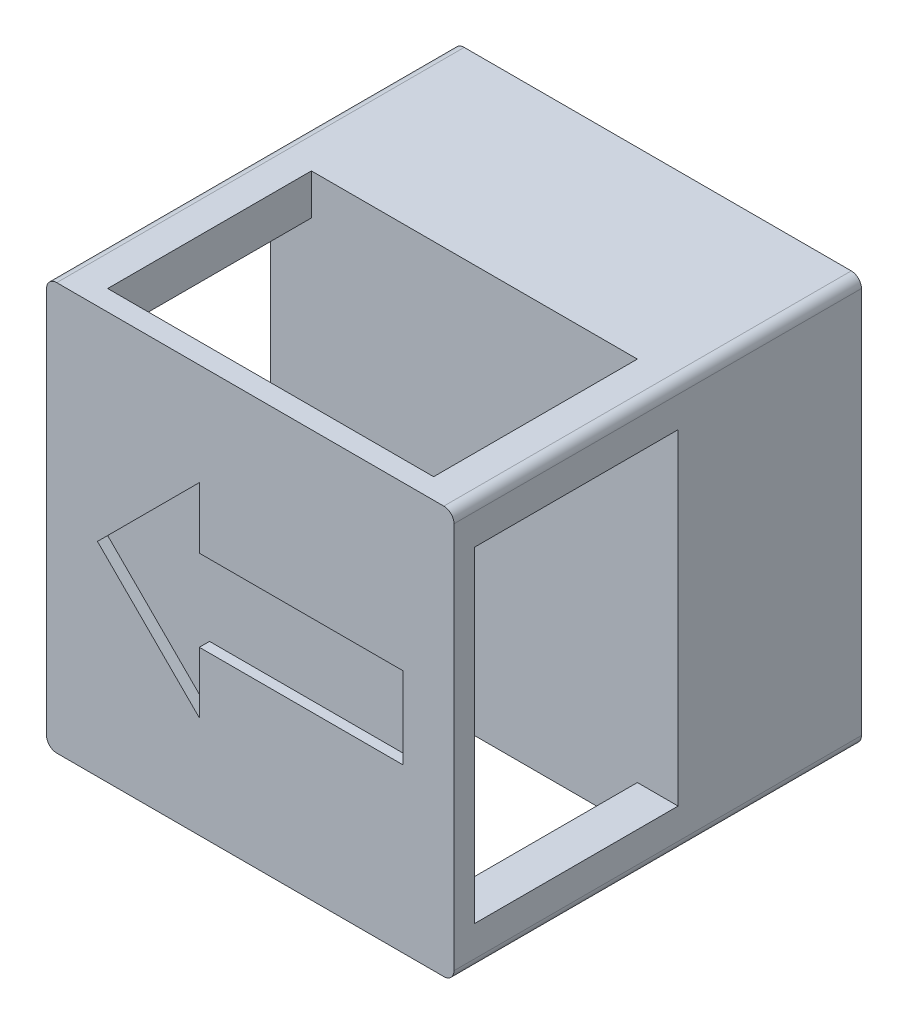
ISO-10303-21;
HEADER;
FILE_DESCRIPTION(('STEP AP214'),'2;1');
FILE_NAME('part.step','',(''),(''),'','','');
FILE_SCHEMA(('AUTOMOTIVE_DESIGN { 1 0 10303 214 1 1 1 1 }'));
ENDSEC;
DATA;
#1=APPLICATION_CONTEXT('core data for automotive mechanical design processes');
#2=APPLICATION_PROTOCOL_DEFINITION('international standard','automotive_design',2000,#1);
#3=PRODUCT_CONTEXT('',#1,'mechanical');
#4=PRODUCT('Part','Part','',(#3));
#5=PRODUCT_RELATED_PRODUCT_CATEGORY('part','',(#4));
#6=PRODUCT_DEFINITION_FORMATION('','',#4);
#7=PRODUCT_DEFINITION_CONTEXT('part definition',#1,'design');
#8=PRODUCT_DEFINITION('design','',#6,#7);
#9=PRODUCT_DEFINITION_SHAPE('','',#8);
#10=(LENGTH_UNIT() NAMED_UNIT(*) SI_UNIT(.MILLI.,.METRE.));
#11=(NAMED_UNIT(*) PLANE_ANGLE_UNIT() SI_UNIT($,.RADIAN.));
#12=(NAMED_UNIT(*) SI_UNIT($,.STERADIAN.) SOLID_ANGLE_UNIT());
#13=UNCERTAINTY_MEASURE_WITH_UNIT(LENGTH_MEASURE(1.E-05),#10,'distance_accuracy_value','');
#14=(GEOMETRIC_REPRESENTATION_CONTEXT(3) GLOBAL_UNCERTAINTY_ASSIGNED_CONTEXT((#13)) GLOBAL_UNIT_ASSIGNED_CONTEXT((#10,
#11,#12)) REPRESENTATION_CONTEXT('',''));
#15=CARTESIAN_POINT('',(0.,0.,0.));
#16=DIRECTION('',(0.,0.,1.));
#17=DIRECTION('',(1.,0.,0.));
#18=AXIS2_PLACEMENT_3D('',#15,#16,#17);
#19=CARTESIAN_POINT('',(200.,-200.,400.));
#20=DIRECTION('',(-1.,0.,0.));
#21=DIRECTION('',(0.,0.,1.));
#22=AXIS2_PLACEMENT_3D('',#19,#20,#21);
#23=PLANE('',#22);
#24=DIRECTION('',(0.,1.,0.));
#25=VECTOR('',#24,1.);
#26=CARTESIAN_POINT('',(200.,-200.,0.));
#27=LINE('',#26,#25);
#28=CARTESIAN_POINT('',(200.,-190.,0.));
#29=VERTEX_POINT('',#28);
#30=CARTESIAN_POINT('',(200.,190.,0.));
#31=VERTEX_POINT('',#30);
#32=EDGE_CURVE('E404',#29,#31,#27,.T.);
#33=ORIENTED_EDGE('',*,*,#32,.T.);
#34=DIRECTION('',(0.,0.,-1.));
#35=VECTOR('',#34,1.);
#36=CARTESIAN_POINT('',(200.,190.,400.));
#37=LINE('',#36,#35);
#38=CARTESIAN_POINT('',(200.,190.,400.));
#39=VERTEX_POINT('',#38);
#40=EDGE_CURVE('E494',#31,#39,#37,.F.);
#41=ORIENTED_EDGE('',*,*,#40,.T.);
#42=DIRECTION('',(0.,1.,0.));
#43=VECTOR('',#42,1.);
#44=CARTESIAN_POINT('',(200.,-200.,400.));
#45=LINE('',#44,#43);
#46=CARTESIAN_POINT('',(200.,-190.,400.));
#47=VERTEX_POINT('',#46);
#48=EDGE_CURVE('E443',#47,#39,#45,.T.);
#49=ORIENTED_EDGE('',*,*,#48,.F.);
#50=DIRECTION('',(0.,0.,-1.));
#51=VECTOR('',#50,1.);
#52=CARTESIAN_POINT('',(200.,-190.,400.));
#53=LINE('',#52,#51);
#54=EDGE_CURVE('E490',#47,#29,#53,.T.);
#55=ORIENTED_EDGE('',*,*,#54,.T.);
#56=EDGE_LOOP('',(#33,#41,#49,#55));
#57=FACE_BOUND('',#56,.T.);
#58=DIRECTION('',(0.,1.,0.));
#59=VECTOR('',#58,1.);
#60=CARTESIAN_POINT('',(200.,0.,180.));
#61=LINE('',#60,#59);
#62=CARTESIAN_POINT('',(200.,-160.,180.));
#63=VERTEX_POINT('',#62);
#64=CARTESIAN_POINT('',(200.,160.,180.));
#65=VERTEX_POINT('',#64);
#66=EDGE_CURVE('E321',#63,#65,#61,.T.);
#67=ORIENTED_EDGE('',*,*,#66,.F.);
#68=DIRECTION('',(0.,0.,1.));
#69=VECTOR('',#68,1.);
#70=CARTESIAN_POINT('',(200.,-160.,180.));
#71=LINE('',#70,#69);
#72=CARTESIAN_POINT('',(200.,-160.,380.));
#73=VERTEX_POINT('',#72);
#74=EDGE_CURVE('E433',#63,#73,#71,.T.);
#75=ORIENTED_EDGE('',*,*,#74,.T.);
#76=DIRECTION('',(0.,1.,0.));
#77=VECTOR('',#76,1.);
#78=CARTESIAN_POINT('',(200.,0.,380.));
#79=LINE('',#78,#77);
#80=CARTESIAN_POINT('',(200.,160.,380.));
#81=VERTEX_POINT('',#80);
#82=EDGE_CURVE('E365',#73,#81,#79,.T.);
#83=ORIENTED_EDGE('',*,*,#82,.T.);
#84=DIRECTION('',(0.,0.,1.));
#85=VECTOR('',#84,1.);
#86=CARTESIAN_POINT('',(200.,160.,180.));
#87=LINE('',#86,#85);
#88=EDGE_CURVE('E429',#65,#81,#87,.T.);
#89=ORIENTED_EDGE('',*,*,#88,.F.);
#90=EDGE_LOOP('',(#67,#75,#83,#89));
#91=FACE_BOUND('',#90,.T.);
#92=ADVANCED_FACE('F38',(#57,#91),#23,.F.);
#93=CARTESIAN_POINT('',(-200.,200.,400.));
#94=DIRECTION('',(0.,-1.,0.));
#95=DIRECTION('',(0.,0.,-1.));
#96=AXIS2_PLACEMENT_3D('',#93,#94,#95);
#97=PLANE('',#96);
#98=DIRECTION('',(-1.,0.,0.));
#99=VECTOR('',#98,1.);
#100=CARTESIAN_POINT('',(-200.,200.,400.));
#101=LINE('',#100,#99);
#102=CARTESIAN_POINT('',(190.,200.,400.));
#103=VERTEX_POINT('',#102);
#104=CARTESIAN_POINT('',(-190.,200.,400.));
#105=VERTEX_POINT('',#104);
#106=EDGE_CURVE('E447',#103,#105,#101,.T.);
#107=ORIENTED_EDGE('',*,*,#106,.F.);
#108=DIRECTION('',(0.,0.,-1.));
#109=VECTOR('',#108,1.);
#110=CARTESIAN_POINT('',(190.,200.,400.));
#111=LINE('',#110,#109);
#112=CARTESIAN_POINT('',(190.,200.,0.));
#113=VERTEX_POINT('',#112);
#114=EDGE_CURVE('E474',#103,#113,#111,.T.);
#115=ORIENTED_EDGE('',*,*,#114,.T.);
#116=DIRECTION('',(-1.,0.,0.));
#117=VECTOR('',#116,1.);
#118=CARTESIAN_POINT('',(-200.,200.,0.));
#119=LINE('',#118,#117);
#120=CARTESIAN_POINT('',(-190.,200.,0.));
#121=VERTEX_POINT('',#120);
#122=EDGE_CURVE('E462',#113,#121,#119,.T.);
#123=ORIENTED_EDGE('',*,*,#122,.T.);
#124=DIRECTION('',(0.,0.,-1.));
#125=VECTOR('',#124,1.);
#126=CARTESIAN_POINT('',(-190.,200.,400.));
#127=LINE('',#126,#125);
#128=EDGE_CURVE('E458',#121,#105,#127,.F.);
#129=ORIENTED_EDGE('',*,*,#128,.T.);
#130=EDGE_LOOP('',(#107,#115,#123,#129));
#131=FACE_BOUND('',#130,.T.);
#132=DIRECTION('',(-1.,0.,0.));
#133=VECTOR('',#132,1.);
#134=CARTESIAN_POINT('',(0.,200.,180.));
#135=LINE('',#134,#133);
#136=CARTESIAN_POINT('',(160.,200.,180.));
#137=VERTEX_POINT('',#136);
#138=CARTESIAN_POINT('',(-160.,200.,180.));
#139=VERTEX_POINT('',#138);
#140=EDGE_CURVE('E332',#137,#139,#135,.T.);
#141=ORIENTED_EDGE('',*,*,#140,.F.);
#142=DIRECTION('',(0.,0.,1.));
#143=VECTOR('',#142,1.);
#144=CARTESIAN_POINT('',(160.,200.,180.));
#145=LINE('',#144,#143);
#146=CARTESIAN_POINT('',(160.,200.,380.));
#147=VERTEX_POINT('',#146);
#148=EDGE_CURVE('E422',#137,#147,#145,.T.);
#149=ORIENTED_EDGE('',*,*,#148,.T.);
#150=DIRECTION('',(-1.,0.,0.));
#151=VECTOR('',#150,1.);
#152=CARTESIAN_POINT('',(0.,200.,380.));
#153=LINE('',#152,#151);
#154=CARTESIAN_POINT('',(-160.,200.,380.));
#155=VERTEX_POINT('',#154);
#156=EDGE_CURVE('E377',#147,#155,#153,.T.);
#157=ORIENTED_EDGE('',*,*,#156,.T.);
#158=DIRECTION('',(0.,0.,1.));
#159=VECTOR('',#158,1.);
#160=CARTESIAN_POINT('',(-160.,200.,180.));
#161=LINE('',#160,#159);
#162=EDGE_CURVE('E419',#139,#155,#161,.T.);
#163=ORIENTED_EDGE('',*,*,#162,.F.);
#164=EDGE_LOOP('',(#141,#149,#157,#163));
#165=FACE_BOUND('',#164,.T.);
#166=ADVANCED_FACE('F548',(#131,#165),#97,.F.);
#167=CARTESIAN_POINT('',(-200.,-200.,400.));
#168=DIRECTION('',(1.,0.,0.));
#169=DIRECTION('',(0.,0.,-1.));
#170=AXIS2_PLACEMENT_3D('',#167,#168,#169);
#171=PLANE('',#170);
#172=DIRECTION('',(0.,-1.,0.));
#173=VECTOR('',#172,1.);
#174=CARTESIAN_POINT('',(-200.,-200.,400.));
#175=LINE('',#174,#173);
#176=CARTESIAN_POINT('',(-200.,190.,400.));
#177=VERTEX_POINT('',#176);
#178=CARTESIAN_POINT('',(-200.,-190.,400.));
#179=VERTEX_POINT('',#178);
#180=EDGE_CURVE('E452',#177,#179,#175,.T.);
#181=ORIENTED_EDGE('',*,*,#180,.F.);
#182=DIRECTION('',(0.,0.,-1.));
#183=VECTOR('',#182,1.);
#184=CARTESIAN_POINT('',(-200.,190.,400.));
#185=LINE('',#184,#183);
#186=CARTESIAN_POINT('',(-200.,190.,0.));
#187=VERTEX_POINT('',#186);
#188=EDGE_CURVE('E511',#177,#187,#185,.T.);
#189=ORIENTED_EDGE('',*,*,#188,.T.);
#190=DIRECTION('',(0.,-1.,0.));
#191=VECTOR('',#190,1.);
#192=CARTESIAN_POINT('',(-200.,-200.,0.));
#193=LINE('',#192,#191);
#194=CARTESIAN_POINT('',(-200.,-190.,0.));
#195=VERTEX_POINT('',#194);
#196=EDGE_CURVE('E466',#187,#195,#193,.T.);
#197=ORIENTED_EDGE('',*,*,#196,.T.);
#198=DIRECTION('',(0.,0.,-1.));
#199=VECTOR('',#198,1.);
#200=CARTESIAN_POINT('',(-200.,-190.,400.));
#201=LINE('',#200,#199);
#202=EDGE_CURVE('E508',#195,#179,#201,.F.);
#203=ORIENTED_EDGE('',*,*,#202,.T.);
#204=EDGE_LOOP('',(#181,#189,#197,#203));
#205=FACE_BOUND('',#204,.T.);
#206=DIRECTION('',(0.,-1.,0.));
#207=VECTOR('',#206,1.);
#208=CARTESIAN_POINT('',(-200.,0.,180.));
#209=LINE('',#208,#207);
#210=CARTESIAN_POINT('',(-200.,160.,180.));
#211=VERTEX_POINT('',#210);
#212=CARTESIAN_POINT('',(-200.,-160.,180.));
#213=VERTEX_POINT('',#212);
#214=EDGE_CURVE('E343',#211,#213,#209,.T.);
#215=ORIENTED_EDGE('',*,*,#214,.F.);
#216=DIRECTION('',(0.,0.,1.));
#217=VECTOR('',#216,1.);
#218=CARTESIAN_POINT('',(-200.,160.,180.));
#219=LINE('',#218,#217);
#220=CARTESIAN_POINT('',(-200.,160.,380.));
#221=VERTEX_POINT('',#220);
#222=EDGE_CURVE('E412',#211,#221,#219,.T.);
#223=ORIENTED_EDGE('',*,*,#222,.T.);
#224=DIRECTION('',(0.,-1.,0.));
#225=VECTOR('',#224,1.);
#226=CARTESIAN_POINT('',(-200.,0.,380.));
#227=LINE('',#226,#225);
#228=CARTESIAN_POINT('',(-200.,-160.,380.));
#229=VERTEX_POINT('',#228);
#230=EDGE_CURVE('E389',#221,#229,#227,.T.);
#231=ORIENTED_EDGE('',*,*,#230,.T.);
#232=DIRECTION('',(0.,0.,1.));
#233=VECTOR('',#232,1.);
#234=CARTESIAN_POINT('',(-200.,-160.,180.));
#235=LINE('',#234,#233);
#236=EDGE_CURVE('E408',#213,#229,#235,.T.);
#237=ORIENTED_EDGE('',*,*,#236,.F.);
#238=EDGE_LOOP('',(#215,#223,#231,#237));
#239=FACE_BOUND('',#238,.T.);
#240=ADVANCED_FACE('F519',(#205,#239),#171,.F.);
#241=CARTESIAN_POINT('',(-200.,-200.,400.));
#242=DIRECTION('',(0.,1.,0.));
#243=DIRECTION('',(0.,0.,1.));
#244=AXIS2_PLACEMENT_3D('',#241,#242,#243);
#245=PLANE('',#244);
#246=DIRECTION('',(1.,0.,0.));
#247=VECTOR('',#246,1.);
#248=CARTESIAN_POINT('',(-200.,-200.,400.));
#249=LINE('',#248,#247);
#250=CARTESIAN_POINT('',(-190.,-200.,400.));
#251=VERTEX_POINT('',#250);
#252=CARTESIAN_POINT('',(190.,-200.,400.));
#253=VERTEX_POINT('',#252);
#254=EDGE_CURVE('E455',#251,#253,#249,.T.);
#255=ORIENTED_EDGE('',*,*,#254,.F.);
#256=DIRECTION('',(0.,0.,-1.));
#257=VECTOR('',#256,1.);
#258=CARTESIAN_POINT('',(-190.,-200.,400.));
#259=LINE('',#258,#257);
#260=CARTESIAN_POINT('',(-190.,-200.,0.));
#261=VERTEX_POINT('',#260);
#262=EDGE_CURVE('E11',#251,#261,#259,.T.);
#263=ORIENTED_EDGE('',*,*,#262,.T.);
#264=DIRECTION('',(1.,0.,0.));
#265=VECTOR('',#264,1.);
#266=CARTESIAN_POINT('',(-200.,-200.,0.));
#267=LINE('',#266,#265);
#268=CARTESIAN_POINT('',(190.,-200.,0.));
#269=VERTEX_POINT('',#268);
#270=EDGE_CURVE('E448',#261,#269,#267,.T.);
#271=ORIENTED_EDGE('',*,*,#270,.T.);
#272=DIRECTION('',(0.,0.,-1.));
#273=VECTOR('',#272,1.);
#274=CARTESIAN_POINT('',(190.,-200.,400.));
#275=LINE('',#274,#273);
#276=EDGE_CURVE('E47',#269,#253,#275,.F.);
#277=ORIENTED_EDGE('',*,*,#276,.T.);
#278=EDGE_LOOP('',(#255,#263,#271,#277));
#279=FACE_BOUND('',#278,.T.);
#280=DIRECTION('',(1.,0.,0.));
#281=VECTOR('',#280,1.);
#282=CARTESIAN_POINT('',(0.,-200.,180.));
#283=LINE('',#282,#281);
#284=CARTESIAN_POINT('',(-160.,-200.,180.));
#285=VERTEX_POINT('',#284);
#286=CARTESIAN_POINT('',(160.,-200.,180.));
#287=VERTEX_POINT('',#286);
#288=EDGE_CURVE('E309',#285,#287,#283,.T.);
#289=ORIENTED_EDGE('',*,*,#288,.F.);
#290=DIRECTION('',(0.,0.,1.));
#291=VECTOR('',#290,1.);
#292=CARTESIAN_POINT('',(-160.,-200.,180.));
#293=LINE('',#292,#291);
#294=CARTESIAN_POINT('',(-160.,-200.,380.));
#295=VERTEX_POINT('',#294);
#296=EDGE_CURVE('E400',#285,#295,#293,.T.);
#297=ORIENTED_EDGE('',*,*,#296,.T.);
#298=DIRECTION('',(1.,0.,0.));
#299=VECTOR('',#298,1.);
#300=CARTESIAN_POINT('',(0.,-200.,380.));
#301=LINE('',#300,#299);
#302=CARTESIAN_POINT('',(160.,-200.,380.));
#303=VERTEX_POINT('',#302);
#304=EDGE_CURVE('E294',#295,#303,#301,.T.);
#305=ORIENTED_EDGE('',*,*,#304,.T.);
#306=DIRECTION('',(0.,0.,1.));
#307=VECTOR('',#306,1.);
#308=CARTESIAN_POINT('',(160.,-200.,180.));
#309=LINE('',#308,#307);
#310=EDGE_CURVE('E354',#287,#303,#309,.T.);
#311=ORIENTED_EDGE('',*,*,#310,.F.);
#312=EDGE_LOOP('',(#289,#297,#305,#311));
#313=FACE_BOUND('',#312,.T.);
#314=ADVANCED_FACE('F531',(#279,#313),#245,.F.);
#315=CARTESIAN_POINT('',(0.,0.,400.));
#316=DIRECTION('',(0.,0.,-1.));
#317=DIRECTION('',(-1.,0.,0.));
#318=AXIS2_PLACEMENT_3D('',#315,#316,#317);
#319=PLANE('',#318);
#320=DIRECTION('',(0.,1.,0.));
#321=VECTOR('',#320,1.);
#322=CARTESIAN_POINT('',(-50.,-40.,400.));
#323=LINE('',#322,#321);
#324=CARTESIAN_POINT('',(-50.,-100.,400.));
#325=VERTEX_POINT('',#324);
#326=CARTESIAN_POINT('',(-50.,-40.,400.));
#327=VERTEX_POINT('',#326);
#328=EDGE_CURVE('E273',#325,#327,#323,.T.);
#329=ORIENTED_EDGE('',*,*,#328,.F.);
#330=DIRECTION('',(0.707106781186547,-0.707106781186547,0.));
#331=VECTOR('',#330,1.);
#332=CARTESIAN_POINT('',(-50.,-100.,400.));
#333=LINE('',#332,#331);
#334=CARTESIAN_POINT('',(-150.,0.,400.));
#335=VERTEX_POINT('',#334);
#336=EDGE_CURVE('E226',#335,#325,#333,.T.);
#337=ORIENTED_EDGE('',*,*,#336,.F.);
#338=DIRECTION('',(-0.707106781186547,-0.707106781186547,0.));
#339=VECTOR('',#338,1.);
#340=CARTESIAN_POINT('',(-150.,0.,400.));
#341=LINE('',#340,#339);
#342=CARTESIAN_POINT('',(-50.,100.,400.));
#343=VERTEX_POINT('',#342);
#344=EDGE_CURVE('E247',#343,#335,#341,.T.);
#345=ORIENTED_EDGE('',*,*,#344,.F.);
#346=DIRECTION('',(0.,1.,0.));
#347=VECTOR('',#346,1.);
#348=CARTESIAN_POINT('',(-50.,100.,400.));
#349=LINE('',#348,#347);
#350=CARTESIAN_POINT('',(-50.,40.,400.));
#351=VERTEX_POINT('',#350);
#352=EDGE_CURVE('E253',#351,#343,#349,.T.);
#353=ORIENTED_EDGE('',*,*,#352,.F.);
#354=DIRECTION('',(-1.,0.,0.));
#355=VECTOR('',#354,1.);
#356=CARTESIAN_POINT('',(-50.,40.,400.));
#357=LINE('',#356,#355);
#358=CARTESIAN_POINT('',(150.,40.,400.));
#359=VERTEX_POINT('',#358);
#360=EDGE_CURVE('E284',#359,#351,#357,.T.);
#361=ORIENTED_EDGE('',*,*,#360,.F.);
#362=DIRECTION('',(0.,1.,0.));
#363=VECTOR('',#362,1.);
#364=CARTESIAN_POINT('',(150.,40.,400.));
#365=LINE('',#364,#363);
#366=CARTESIAN_POINT('',(150.,-40.,400.));
#367=VERTEX_POINT('',#366);
#368=EDGE_CURVE('E280',#367,#359,#365,.T.);
#369=ORIENTED_EDGE('',*,*,#368,.F.);
#370=DIRECTION('',(1.,0.,0.));
#371=VECTOR('',#370,1.);
#372=CARTESIAN_POINT('',(150.,-40.,400.));
#373=LINE('',#372,#371);
#374=EDGE_CURVE('E276',#327,#367,#373,.T.);
#375=ORIENTED_EDGE('',*,*,#374,.F.);
#376=EDGE_LOOP('',(#329,#337,#345,#353,#361,#369,#375));
#377=FACE_BOUND('',#376,.T.);
#378=ORIENTED_EDGE('',*,*,#48,.T.);
#379=CARTESIAN_POINT('',(190.,190.,400.));
#380=DIRECTION('',(0.,0.,-1.));
#381=DIRECTION('',(-1.,0.,0.));
#382=AXIS2_PLACEMENT_3D('',#379,#380,#381);
#383=CIRCLE('',#382,10.);
#384=EDGE_CURVE('E505',#39,#103,#383,.F.);
#385=ORIENTED_EDGE('',*,*,#384,.T.);
#386=ORIENTED_EDGE('',*,*,#106,.T.);
#387=CARTESIAN_POINT('',(-190.,190.,400.));
#388=DIRECTION('',(0.,0.,-1.));
#389=DIRECTION('',(-1.,0.,0.));
#390=AXIS2_PLACEMENT_3D('',#387,#388,#389);
#391=CIRCLE('',#390,10.);
#392=EDGE_CURVE('E502',#105,#177,#391,.F.);
#393=ORIENTED_EDGE('',*,*,#392,.T.);
#394=ORIENTED_EDGE('',*,*,#180,.T.);
#395=CARTESIAN_POINT('',(-190.,-190.,400.));
#396=DIRECTION('',(0.,0.,-1.));
#397=DIRECTION('',(-1.,0.,0.));
#398=AXIS2_PLACEMENT_3D('',#395,#396,#397);
#399=CIRCLE('',#398,10.);
#400=EDGE_CURVE('E60',#179,#251,#399,.F.);
#401=ORIENTED_EDGE('',*,*,#400,.T.);
#402=ORIENTED_EDGE('',*,*,#254,.T.);
#403=CARTESIAN_POINT('',(190.,-190.,400.));
#404=DIRECTION('',(0.,0.,-1.));
#405=DIRECTION('',(-1.,0.,0.));
#406=AXIS2_PLACEMENT_3D('',#403,#404,#405);
#407=CIRCLE('',#406,10.);
#408=EDGE_CURVE('E497',#253,#47,#407,.F.);
#409=ORIENTED_EDGE('',*,*,#408,.T.);
#410=EDGE_LOOP('',(#378,#385,#386,#393,#394,#401,#402,#409));
#411=FACE_BOUND('',#410,.T.);
#412=ADVANCED_FACE('F534',(#377,#411),#319,.F.);
#413=CARTESIAN_POINT('',(0.,0.,0.));
#414=DIRECTION('',(0.,0.,-1.));
#415=DIRECTION('',(-1.,0.,0.));
#416=AXIS2_PLACEMENT_3D('',#413,#414,#415);
#417=PLANE('',#416);
#418=ORIENTED_EDGE('',*,*,#122,.F.);
#419=CARTESIAN_POINT('',(190.,190.,0.));
#420=DIRECTION('',(0.,0.,-1.));
#421=DIRECTION('',(-1.,0.,0.));
#422=AXIS2_PLACEMENT_3D('',#419,#420,#421);
#423=CIRCLE('',#422,10.);
#424=EDGE_CURVE('E487',#113,#31,#423,.T.);
#425=ORIENTED_EDGE('',*,*,#424,.T.);
#426=ORIENTED_EDGE('',*,*,#32,.F.);
#427=CARTESIAN_POINT('',(190.,-190.,0.));
#428=DIRECTION('',(0.,0.,-1.));
#429=DIRECTION('',(-1.,0.,0.));
#430=AXIS2_PLACEMENT_3D('',#427,#428,#429);
#431=CIRCLE('',#430,10.);
#432=EDGE_CURVE('E478',#29,#269,#431,.T.);
#433=ORIENTED_EDGE('',*,*,#432,.T.);
#434=ORIENTED_EDGE('',*,*,#270,.F.);
#435=CARTESIAN_POINT('',(-190.,-190.,0.));
#436=DIRECTION('',(0.,0.,-1.));
#437=DIRECTION('',(-1.,0.,0.));
#438=AXIS2_PLACEMENT_3D('',#435,#436,#437);
#439=CIRCLE('',#438,10.);
#440=EDGE_CURVE('E481',#261,#195,#439,.T.);
#441=ORIENTED_EDGE('',*,*,#440,.T.);
#442=ORIENTED_EDGE('',*,*,#196,.F.);
#443=CARTESIAN_POINT('',(-190.,190.,0.));
#444=DIRECTION('',(0.,0.,-1.));
#445=DIRECTION('',(-1.,0.,0.));
#446=AXIS2_PLACEMENT_3D('',#443,#444,#445);
#447=CIRCLE('',#446,10.);
#448=EDGE_CURVE('E484',#187,#121,#447,.T.);
#449=ORIENTED_EDGE('',*,*,#448,.T.);
#450=EDGE_LOOP('',(#418,#425,#426,#433,#434,#441,#442,#449));
#451=FACE_BOUND('',#450,.T.);
#452=ADVANCED_FACE('F526',(#451),#417,.T.);
#453=CARTESIAN_POINT('',(-160.,0.,180.));
#454=DIRECTION('',(1.,0.,0.));
#455=DIRECTION('',(0.,0.,-1.));
#456=AXIS2_PLACEMENT_3D('',#453,#454,#455);
#457=PLANE('',#456);
#458=DIRECTION('',(0.,1.,0.));
#459=VECTOR('',#458,1.);
#460=CARTESIAN_POINT('',(-160.,0.,380.));
#461=LINE('',#460,#459);
#462=CARTESIAN_POINT('',(-160.,-160.,380.));
#463=VERTEX_POINT('',#462);
#464=EDGE_CURVE('E314',#295,#463,#461,.T.);
#465=ORIENTED_EDGE('',*,*,#464,.F.);
#466=ORIENTED_EDGE('',*,*,#296,.F.);
#467=DIRECTION('',(0.,1.,0.));
#468=VECTOR('',#467,1.);
#469=CARTESIAN_POINT('',(-160.,0.,180.));
#470=LINE('',#469,#468);
#471=CARTESIAN_POINT('',(-160.,-160.,180.));
#472=VERTEX_POINT('',#471);
#473=EDGE_CURVE('E351',#285,#472,#470,.T.);
#474=ORIENTED_EDGE('',*,*,#473,.T.);
#475=DIRECTION('',(0.,0.,1.));
#476=VECTOR('',#475,1.);
#477=CARTESIAN_POINT('',(-160.,-160.,180.));
#478=LINE('',#477,#476);
#479=EDGE_CURVE('E405',#472,#463,#478,.T.);
#480=ORIENTED_EDGE('',*,*,#479,.T.);
#481=EDGE_LOOP('',(#465,#466,#474,#480));
#482=FACE_BOUND('',#481,.T.);
#483=ADVANCED_FACE('F572',(#482),#457,.T.);
#484=CARTESIAN_POINT('',(0.,-160.,180.));
#485=DIRECTION('',(0.,-1.,0.));
#486=DIRECTION('',(0.,0.,-1.));
#487=AXIS2_PLACEMENT_3D('',#484,#485,#486);
#488=PLANE('',#487);
#489=DIRECTION('',(1.,0.,0.));
#490=VECTOR('',#489,1.);
#491=CARTESIAN_POINT('',(0.,-160.,380.));
#492=LINE('',#491,#490);
#493=EDGE_CURVE('E393',#229,#463,#492,.T.);
#494=ORIENTED_EDGE('',*,*,#493,.T.);
#495=ORIENTED_EDGE('',*,*,#479,.F.);
#496=DIRECTION('',(1.,0.,0.));
#497=VECTOR('',#496,1.);
#498=CARTESIAN_POINT('',(0.,-160.,180.));
#499=LINE('',#498,#497);
#500=EDGE_CURVE('E347',#213,#472,#499,.T.);
#501=ORIENTED_EDGE('',*,*,#500,.F.);
#502=ORIENTED_EDGE('',*,*,#236,.T.);
#503=EDGE_LOOP('',(#494,#495,#501,#502));
#504=FACE_BOUND('',#503,.T.);
#505=ADVANCED_FACE('F600',(#504),#488,.F.);
#506=CARTESIAN_POINT('',(0.,160.,180.));
#507=DIRECTION('',(0.,-1.,0.));
#508=DIRECTION('',(0.,0.,-1.));
#509=AXIS2_PLACEMENT_3D('',#506,#507,#508);
#510=PLANE('',#509);
#511=DIRECTION('',(1.,0.,0.));
#512=VECTOR('',#511,1.);
#513=CARTESIAN_POINT('',(0.,160.,380.));
#514=LINE('',#513,#512);
#515=CARTESIAN_POINT('',(-160.,160.,380.));
#516=VERTEX_POINT('',#515);
#517=EDGE_CURVE('E385',#221,#516,#514,.T.);
#518=ORIENTED_EDGE('',*,*,#517,.F.);
#519=ORIENTED_EDGE('',*,*,#222,.F.);
#520=DIRECTION('',(1.,0.,0.));
#521=VECTOR('',#520,1.);
#522=CARTESIAN_POINT('',(0.,160.,180.));
#523=LINE('',#522,#521);
#524=CARTESIAN_POINT('',(-160.,160.,180.));
#525=VERTEX_POINT('',#524);
#526=EDGE_CURVE('E340',#211,#525,#523,.T.);
#527=ORIENTED_EDGE('',*,*,#526,.T.);
#528=DIRECTION('',(0.,0.,1.));
#529=VECTOR('',#528,1.);
#530=CARTESIAN_POINT('',(-160.,160.,180.));
#531=LINE('',#530,#529);
#532=EDGE_CURVE('E416',#525,#516,#531,.T.);
#533=ORIENTED_EDGE('',*,*,#532,.T.);
#534=EDGE_LOOP('',(#518,#519,#527,#533));
#535=FACE_BOUND('',#534,.T.);
#536=ADVANCED_FACE('F596',(#535),#510,.T.);
#537=CARTESIAN_POINT('',(-160.,0.,180.));
#538=DIRECTION('',(-1.,0.,0.));
#539=DIRECTION('',(0.,0.,1.));
#540=AXIS2_PLACEMENT_3D('',#537,#538,#539);
#541=PLANE('',#540);
#542=DIRECTION('',(0.,-1.,0.));
#543=VECTOR('',#542,1.);
#544=CARTESIAN_POINT('',(-160.,0.,380.));
#545=LINE('',#544,#543);
#546=EDGE_CURVE('E381',#155,#516,#545,.T.);
#547=ORIENTED_EDGE('',*,*,#546,.T.);
#548=ORIENTED_EDGE('',*,*,#532,.F.);
#549=DIRECTION('',(0.,-1.,0.));
#550=VECTOR('',#549,1.);
#551=CARTESIAN_POINT('',(-160.,0.,180.));
#552=LINE('',#551,#550);
#553=EDGE_CURVE('E336',#139,#525,#552,.T.);
#554=ORIENTED_EDGE('',*,*,#553,.F.);
#555=ORIENTED_EDGE('',*,*,#162,.T.);
#556=EDGE_LOOP('',(#547,#548,#554,#555));
#557=FACE_BOUND('',#556,.T.);
#558=ADVANCED_FACE('F592',(#557),#541,.F.);
#559=CARTESIAN_POINT('',(160.,0.,180.));
#560=DIRECTION('',(-1.,0.,0.));
#561=DIRECTION('',(0.,0.,1.));
#562=AXIS2_PLACEMENT_3D('',#559,#560,#561);
#563=PLANE('',#562);
#564=DIRECTION('',(0.,-1.,0.));
#565=VECTOR('',#564,1.);
#566=CARTESIAN_POINT('',(160.,0.,380.));
#567=LINE('',#566,#565);
#568=CARTESIAN_POINT('',(160.,160.,380.));
#569=VERTEX_POINT('',#568);
#570=EDGE_CURVE('E373',#147,#569,#567,.T.);
#571=ORIENTED_EDGE('',*,*,#570,.F.);
#572=ORIENTED_EDGE('',*,*,#148,.F.);
#573=DIRECTION('',(0.,-1.,0.));
#574=VECTOR('',#573,1.);
#575=CARTESIAN_POINT('',(160.,0.,180.));
#576=LINE('',#575,#574);
#577=CARTESIAN_POINT('',(160.,160.,180.));
#578=VERTEX_POINT('',#577);
#579=EDGE_CURVE('E329',#137,#578,#576,.T.);
#580=ORIENTED_EDGE('',*,*,#579,.T.);
#581=DIRECTION('',(0.,0.,1.));
#582=VECTOR('',#581,1.);
#583=CARTESIAN_POINT('',(160.,160.,180.));
#584=LINE('',#583,#582);
#585=EDGE_CURVE('E426',#578,#569,#584,.T.);
#586=ORIENTED_EDGE('',*,*,#585,.T.);
#587=EDGE_LOOP('',(#571,#572,#580,#586));
#588=FACE_BOUND('',#587,.T.);
#589=ADVANCED_FACE('F588',(#588),#563,.T.);
#590=CARTESIAN_POINT('',(0.,160.,180.));
#591=DIRECTION('',(0.,1.,0.));
#592=DIRECTION('',(0.,0.,1.));
#593=AXIS2_PLACEMENT_3D('',#590,#591,#592);
#594=PLANE('',#593);
#595=DIRECTION('',(-1.,0.,0.));
#596=VECTOR('',#595,1.);
#597=CARTESIAN_POINT('',(0.,160.,380.));
#598=LINE('',#597,#596);
#599=EDGE_CURVE('E369',#81,#569,#598,.T.);
#600=ORIENTED_EDGE('',*,*,#599,.T.);
#601=ORIENTED_EDGE('',*,*,#585,.F.);
#602=DIRECTION('',(-1.,0.,0.));
#603=VECTOR('',#602,1.);
#604=CARTESIAN_POINT('',(0.,160.,180.));
#605=LINE('',#604,#603);
#606=EDGE_CURVE('E325',#65,#578,#605,.T.);
#607=ORIENTED_EDGE('',*,*,#606,.F.);
#608=ORIENTED_EDGE('',*,*,#88,.T.);
#609=EDGE_LOOP('',(#600,#601,#607,#608));
#610=FACE_BOUND('',#609,.T.);
#611=ADVANCED_FACE('F584',(#610),#594,.F.);
#612=CARTESIAN_POINT('',(0.,-160.,180.));
#613=DIRECTION('',(0.,1.,0.));
#614=DIRECTION('',(0.,0.,1.));
#615=AXIS2_PLACEMENT_3D('',#612,#613,#614);
#616=PLANE('',#615);
#617=DIRECTION('',(-1.,0.,0.));
#618=VECTOR('',#617,1.);
#619=CARTESIAN_POINT('',(0.,-160.,380.));
#620=LINE('',#619,#618);
#621=CARTESIAN_POINT('',(160.,-160.,380.));
#622=VERTEX_POINT('',#621);
#623=EDGE_CURVE('E362',#73,#622,#620,.T.);
#624=ORIENTED_EDGE('',*,*,#623,.F.);
#625=ORIENTED_EDGE('',*,*,#74,.F.);
#626=DIRECTION('',(-1.,0.,0.));
#627=VECTOR('',#626,1.);
#628=CARTESIAN_POINT('',(0.,-160.,180.));
#629=LINE('',#628,#627);
#630=CARTESIAN_POINT('',(160.,-160.,180.));
#631=VERTEX_POINT('',#630);
#632=EDGE_CURVE('E318',#63,#631,#629,.T.);
#633=ORIENTED_EDGE('',*,*,#632,.T.);
#634=DIRECTION('',(0.,0.,1.));
#635=VECTOR('',#634,1.);
#636=CARTESIAN_POINT('',(160.,-160.,180.));
#637=LINE('',#636,#635);
#638=EDGE_CURVE('E437',#631,#622,#637,.T.);
#639=ORIENTED_EDGE('',*,*,#638,.T.);
#640=EDGE_LOOP('',(#624,#625,#633,#639));
#641=FACE_BOUND('',#640,.T.);
#642=ADVANCED_FACE('F580',(#641),#616,.T.);
#643=CARTESIAN_POINT('',(160.,0.,180.));
#644=DIRECTION('',(1.,0.,0.));
#645=DIRECTION('',(0.,0.,-1.));
#646=AXIS2_PLACEMENT_3D('',#643,#644,#645);
#647=PLANE('',#646);
#648=DIRECTION('',(0.,1.,0.));
#649=VECTOR('',#648,1.);
#650=CARTESIAN_POINT('',(160.,0.,380.));
#651=LINE('',#650,#649);
#652=EDGE_CURVE('E358',#303,#622,#651,.T.);
#653=ORIENTED_EDGE('',*,*,#652,.T.);
#654=ORIENTED_EDGE('',*,*,#638,.F.);
#655=DIRECTION('',(0.,1.,0.));
#656=VECTOR('',#655,1.);
#657=CARTESIAN_POINT('',(160.,0.,180.));
#658=LINE('',#657,#656);
#659=EDGE_CURVE('E313',#287,#631,#658,.T.);
#660=ORIENTED_EDGE('',*,*,#659,.F.);
#661=ORIENTED_EDGE('',*,*,#310,.T.);
#662=EDGE_LOOP('',(#653,#654,#660,#661));
#663=FACE_BOUND('',#662,.T.);
#664=ADVANCED_FACE('F576',(#663),#647,.F.);
#665=CARTESIAN_POINT('',(0.,0.,180.));
#666=DIRECTION('',(0.,0.,1.));
#667=DIRECTION('',(1.,0.,0.));
#668=AXIS2_PLACEMENT_3D('',#665,#666,#667);
#669=PLANE('',#668);
#670=ORIENTED_EDGE('',*,*,#288,.T.);
#671=ORIENTED_EDGE('',*,*,#659,.T.);
#672=ORIENTED_EDGE('',*,*,#632,.F.);
#673=ORIENTED_EDGE('',*,*,#66,.T.);
#674=ORIENTED_EDGE('',*,*,#606,.T.);
#675=ORIENTED_EDGE('',*,*,#579,.F.);
#676=ORIENTED_EDGE('',*,*,#140,.T.);
#677=ORIENTED_EDGE('',*,*,#553,.T.);
#678=ORIENTED_EDGE('',*,*,#526,.F.);
#679=ORIENTED_EDGE('',*,*,#214,.T.);
#680=ORIENTED_EDGE('',*,*,#500,.T.);
#681=ORIENTED_EDGE('',*,*,#473,.F.);
#682=EDGE_LOOP('',(#670,#671,#672,#673,#674,#675,#676,#677,#678,#679,#680,#681));
#683=FACE_BOUND('',#682,.T.);
#684=ADVANCED_FACE('F579',(#683),#669,.T.);
#685=CARTESIAN_POINT('',(0.,0.,380.));
#686=DIRECTION('',(0.,0.,1.));
#687=DIRECTION('',(1.,0.,0.));
#688=AXIS2_PLACEMENT_3D('',#685,#686,#687);
#689=PLANE('',#688);
#690=ORIENTED_EDGE('',*,*,#304,.F.);
#691=ORIENTED_EDGE('',*,*,#464,.T.);
#692=ORIENTED_EDGE('',*,*,#493,.F.);
#693=ORIENTED_EDGE('',*,*,#230,.F.);
#694=ORIENTED_EDGE('',*,*,#517,.T.);
#695=ORIENTED_EDGE('',*,*,#546,.F.);
#696=ORIENTED_EDGE('',*,*,#156,.F.);
#697=ORIENTED_EDGE('',*,*,#570,.T.);
#698=ORIENTED_EDGE('',*,*,#599,.F.);
#699=ORIENTED_EDGE('',*,*,#82,.F.);
#700=ORIENTED_EDGE('',*,*,#623,.T.);
#701=ORIENTED_EDGE('',*,*,#652,.F.);
#702=EDGE_LOOP('',(#690,#691,#692,#693,#694,#695,#696,#697,#698,#699,#700,#701));
#703=FACE_BOUND('',#702,.T.);
#704=ADVANCED_FACE('F608',(#703),#689,.F.);
#705=CARTESIAN_POINT('',(-50.,-100.,390.));
#706=DIRECTION('',(-0.707106781186548,-0.707106781186548,0.));
#707=DIRECTION('',(0.707106781186548,-0.707106781186548,0.));
#708=AXIS2_PLACEMENT_3D('',#705,#706,#707);
#709=PLANE('',#708);
#710=ORIENTED_EDGE('',*,*,#336,.T.);
#711=DIRECTION('',(0.,0.,1.));
#712=VECTOR('',#711,1.);
#713=CARTESIAN_POINT('',(-50.,-100.,390.));
#714=LINE('',#713,#712);
#715=CARTESIAN_POINT('',(-50.,-100.,390.));
#716=VERTEX_POINT('',#715);
#717=EDGE_CURVE('E219',#716,#325,#714,.T.);
#718=ORIENTED_EDGE('',*,*,#717,.F.);
#719=DIRECTION('',(0.707106781186547,-0.707106781186547,0.));
#720=VECTOR('',#719,1.);
#721=CARTESIAN_POINT('',(-50.,-100.,390.));
#722=LINE('',#721,#720);
#723=CARTESIAN_POINT('',(-150.,0.,390.));
#724=VERTEX_POINT('',#723);
#725=EDGE_CURVE('E223',#724,#716,#722,.T.);
#726=ORIENTED_EDGE('',*,*,#725,.F.);
#727=DIRECTION('',(0.,0.,1.));
#728=VECTOR('',#727,1.);
#729=CARTESIAN_POINT('',(-150.,0.,390.));
#730=LINE('',#729,#728);
#731=EDGE_CURVE('E291',#724,#335,#730,.T.);
#732=ORIENTED_EDGE('',*,*,#731,.T.);
#733=EDGE_LOOP('',(#710,#718,#726,#732));
#734=FACE_BOUND('',#733,.T.);
#735=ADVANCED_FACE('F221',(#734),#709,.F.);
#736=CARTESIAN_POINT('',(-150.,0.,390.));
#737=DIRECTION('',(-0.707106781186548,0.707106781186548,0.));
#738=DIRECTION('',(-0.707106781186548,-0.707106781186548,0.));
#739=AXIS2_PLACEMENT_3D('',#736,#737,#738);
#740=PLANE('',#739);
#741=ORIENTED_EDGE('',*,*,#344,.T.);
#742=ORIENTED_EDGE('',*,*,#731,.F.);
#743=DIRECTION('',(-0.707106781186547,-0.707106781186547,0.));
#744=VECTOR('',#743,1.);
#745=CARTESIAN_POINT('',(-150.,0.,390.));
#746=LINE('',#745,#744);
#747=CARTESIAN_POINT('',(-50.,100.,390.));
#748=VERTEX_POINT('',#747);
#749=EDGE_CURVE('E232',#748,#724,#746,.T.);
#750=ORIENTED_EDGE('',*,*,#749,.F.);
#751=DIRECTION('',(0.,0.,1.));
#752=VECTOR('',#751,1.);
#753=CARTESIAN_POINT('',(-50.,100.,390.));
#754=LINE('',#753,#752);
#755=EDGE_CURVE('E295',#748,#343,#754,.T.);
#756=ORIENTED_EDGE('',*,*,#755,.T.);
#757=EDGE_LOOP('',(#741,#742,#750,#756));
#758=FACE_BOUND('',#757,.T.);
#759=ADVANCED_FACE('F617',(#758),#740,.F.);
#760=CARTESIAN_POINT('',(-50.,100.,390.));
#761=DIRECTION('',(1.,0.,0.));
#762=DIRECTION('',(0.,1.,0.));
#763=AXIS2_PLACEMENT_3D('',#760,#761,#762);
#764=PLANE('',#763);
#765=ORIENTED_EDGE('',*,*,#352,.T.);
#766=ORIENTED_EDGE('',*,*,#755,.F.);
#767=DIRECTION('',(0.,1.,0.));
#768=VECTOR('',#767,1.);
#769=CARTESIAN_POINT('',(-50.,100.,390.));
#770=LINE('',#769,#768);
#771=CARTESIAN_POINT('',(-50.,40.,390.));
#772=VERTEX_POINT('',#771);
#773=EDGE_CURVE('E266',#772,#748,#770,.T.);
#774=ORIENTED_EDGE('',*,*,#773,.F.);
#775=DIRECTION('',(0.,0.,1.));
#776=VECTOR('',#775,1.);
#777=CARTESIAN_POINT('',(-50.,40.,390.));
#778=LINE('',#777,#776);
#779=EDGE_CURVE('E298',#772,#351,#778,.T.);
#780=ORIENTED_EDGE('',*,*,#779,.T.);
#781=EDGE_LOOP('',(#765,#766,#774,#780));
#782=FACE_BOUND('',#781,.T.);
#783=ADVANCED_FACE('F631',(#782),#764,.F.);
#784=CARTESIAN_POINT('',(-50.,40.,390.));
#785=DIRECTION('',(0.,1.,0.));
#786=DIRECTION('',(-1.,0.,0.));
#787=AXIS2_PLACEMENT_3D('',#784,#785,#786);
#788=PLANE('',#787);
#789=ORIENTED_EDGE('',*,*,#360,.T.);
#790=ORIENTED_EDGE('',*,*,#779,.F.);
#791=DIRECTION('',(-1.,0.,0.));
#792=VECTOR('',#791,1.);
#793=CARTESIAN_POINT('',(-50.,40.,390.));
#794=LINE('',#793,#792);
#795=CARTESIAN_POINT('',(150.,40.,390.));
#796=VERTEX_POINT('',#795);
#797=EDGE_CURVE('E262',#796,#772,#794,.T.);
#798=ORIENTED_EDGE('',*,*,#797,.F.);
#799=DIRECTION('',(0.,0.,1.));
#800=VECTOR('',#799,1.);
#801=CARTESIAN_POINT('',(150.,40.,390.));
#802=LINE('',#801,#800);
#803=EDGE_CURVE('E301',#796,#359,#802,.T.);
#804=ORIENTED_EDGE('',*,*,#803,.T.);
#805=EDGE_LOOP('',(#789,#790,#798,#804));
#806=FACE_BOUND('',#805,.T.);
#807=ADVANCED_FACE('F627',(#806),#788,.F.);
#808=CARTESIAN_POINT('',(150.,40.,390.));
#809=DIRECTION('',(1.,0.,0.));
#810=DIRECTION('',(0.,0.,-1.));
#811=AXIS2_PLACEMENT_3D('',#808,#809,#810);
#812=PLANE('',#811);
#813=ORIENTED_EDGE('',*,*,#368,.T.);
#814=ORIENTED_EDGE('',*,*,#803,.F.);
#815=DIRECTION('',(0.,1.,0.));
#816=VECTOR('',#815,1.);
#817=CARTESIAN_POINT('',(150.,40.,390.));
#818=LINE('',#817,#816);
#819=CARTESIAN_POINT('',(150.,-40.,390.));
#820=VERTEX_POINT('',#819);
#821=EDGE_CURVE('E258',#820,#796,#818,.T.);
#822=ORIENTED_EDGE('',*,*,#821,.F.);
#823=DIRECTION('',(0.,0.,1.));
#824=VECTOR('',#823,1.);
#825=CARTESIAN_POINT('',(150.,-40.,390.));
#826=LINE('',#825,#824);
#827=EDGE_CURVE('E304',#820,#367,#826,.T.);
#828=ORIENTED_EDGE('',*,*,#827,.T.);
#829=EDGE_LOOP('',(#813,#814,#822,#828));
#830=FACE_BOUND('',#829,.T.);
#831=ADVANCED_FACE('F623',(#830),#812,.F.);
#832=CARTESIAN_POINT('',(150.,-40.,390.));
#833=DIRECTION('',(0.,-1.,0.));
#834=DIRECTION('',(1.,0.,0.));
#835=AXIS2_PLACEMENT_3D('',#832,#833,#834);
#836=PLANE('',#835);
#837=ORIENTED_EDGE('',*,*,#374,.T.);
#838=ORIENTED_EDGE('',*,*,#827,.F.);
#839=DIRECTION('',(1.,0.,0.));
#840=VECTOR('',#839,1.);
#841=CARTESIAN_POINT('',(150.,-40.,390.));
#842=LINE('',#841,#840);
#843=CARTESIAN_POINT('',(-50.,-40.,390.));
#844=VERTEX_POINT('',#843);
#845=EDGE_CURVE('E241',#844,#820,#842,.T.);
#846=ORIENTED_EDGE('',*,*,#845,.F.);
#847=DIRECTION('',(0.,0.,1.));
#848=VECTOR('',#847,1.);
#849=CARTESIAN_POINT('',(-50.,-40.,390.));
#850=LINE('',#849,#848);
#851=EDGE_CURVE('E231',#844,#327,#850,.T.);
#852=ORIENTED_EDGE('',*,*,#851,.T.);
#853=EDGE_LOOP('',(#837,#838,#846,#852));
#854=FACE_BOUND('',#853,.T.);
#855=ADVANCED_FACE('F620',(#854),#836,.F.);
#856=CARTESIAN_POINT('',(-50.,-40.,390.));
#857=DIRECTION('',(1.,0.,0.));
#858=DIRECTION('',(0.,0.,-1.));
#859=AXIS2_PLACEMENT_3D('',#856,#857,#858);
#860=PLANE('',#859);
#861=ORIENTED_EDGE('',*,*,#328,.T.);
#862=ORIENTED_EDGE('',*,*,#851,.F.);
#863=DIRECTION('',(0.,1.,0.));
#864=VECTOR('',#863,1.);
#865=CARTESIAN_POINT('',(-50.,-40.,390.));
#866=LINE('',#865,#864);
#867=EDGE_CURVE('E235',#716,#844,#866,.T.);
#868=ORIENTED_EDGE('',*,*,#867,.F.);
#869=ORIENTED_EDGE('',*,*,#717,.T.);
#870=EDGE_LOOP('',(#861,#862,#868,#869));
#871=FACE_BOUND('',#870,.T.);
#872=ADVANCED_FACE('F236',(#871),#860,.F.);
#873=CARTESIAN_POINT('',(0.,0.,390.));
#874=DIRECTION('',(0.,0.,-1.));
#875=DIRECTION('',(-1.,0.,0.));
#876=AXIS2_PLACEMENT_3D('',#873,#874,#875);
#877=PLANE('',#876);
#878=ORIENTED_EDGE('',*,*,#725,.T.);
#879=ORIENTED_EDGE('',*,*,#867,.T.);
#880=ORIENTED_EDGE('',*,*,#845,.T.);
#881=ORIENTED_EDGE('',*,*,#821,.T.);
#882=ORIENTED_EDGE('',*,*,#797,.T.);
#883=ORIENTED_EDGE('',*,*,#773,.T.);
#884=ORIENTED_EDGE('',*,*,#749,.T.);
#885=EDGE_LOOP('',(#878,#879,#880,#881,#882,#883,#884));
#886=FACE_BOUND('',#885,.T.);
#887=ADVANCED_FACE('F243',(#886),#877,.F.);
#888=CARTESIAN_POINT('',(190.,190.,400.));
#889=DIRECTION('',(0.,0.,-1.));
#890=DIRECTION('',(-1.,0.,0.));
#891=AXIS2_PLACEMENT_3D('',#888,#889,#890);
#892=CYLINDRICAL_SURFACE('',#891,10.);
#893=ORIENTED_EDGE('',*,*,#384,.F.);
#894=ORIENTED_EDGE('',*,*,#40,.F.);
#895=ORIENTED_EDGE('',*,*,#424,.F.);
#896=ORIENTED_EDGE('',*,*,#114,.F.);
#897=EDGE_LOOP('',(#893,#894,#895,#896));
#898=FACE_BOUND('',#897,.T.);
#899=ADVANCED_FACE('F545',(#898),#892,.T.);
#900=CARTESIAN_POINT('',(-190.,190.,400.));
#901=DIRECTION('',(0.,0.,-1.));
#902=DIRECTION('',(-1.,0.,0.));
#903=AXIS2_PLACEMENT_3D('',#900,#901,#902);
#904=CYLINDRICAL_SURFACE('',#903,10.);
#905=ORIENTED_EDGE('',*,*,#392,.F.);
#906=ORIENTED_EDGE('',*,*,#128,.F.);
#907=ORIENTED_EDGE('',*,*,#448,.F.);
#908=ORIENTED_EDGE('',*,*,#188,.F.);
#909=EDGE_LOOP('',(#905,#906,#907,#908));
#910=FACE_BOUND('',#909,.T.);
#911=ADVANCED_FACE('F551',(#910),#904,.T.);
#912=CARTESIAN_POINT('',(-190.,-190.,400.));
#913=DIRECTION('',(0.,0.,-1.));
#914=DIRECTION('',(-1.,0.,0.));
#915=AXIS2_PLACEMENT_3D('',#912,#913,#914);
#916=CYLINDRICAL_SURFACE('',#915,10.);
#917=ORIENTED_EDGE('',*,*,#400,.F.);
#918=ORIENTED_EDGE('',*,*,#202,.F.);
#919=ORIENTED_EDGE('',*,*,#440,.F.);
#920=ORIENTED_EDGE('',*,*,#262,.F.);
#921=EDGE_LOOP('',(#917,#918,#919,#920));
#922=FACE_BOUND('',#921,.T.);
#923=ADVANCED_FACE('F530',(#922),#916,.T.);
#924=CARTESIAN_POINT('',(190.,-190.,400.));
#925=DIRECTION('',(0.,0.,-1.));
#926=DIRECTION('',(-1.,0.,0.));
#927=AXIS2_PLACEMENT_3D('',#924,#925,#926);
#928=CYLINDRICAL_SURFACE('',#927,10.);
#929=ORIENTED_EDGE('',*,*,#408,.F.);
#930=ORIENTED_EDGE('',*,*,#276,.F.);
#931=ORIENTED_EDGE('',*,*,#432,.F.);
#932=ORIENTED_EDGE('',*,*,#54,.F.);
#933=EDGE_LOOP('',(#929,#930,#931,#932));
#934=FACE_BOUND('',#933,.T.);
#935=ADVANCED_FACE('F40',(#934),#928,.T.);
#936=CLOSED_SHELL('',(#92,#166,#240,#314,#412,#452,#483,#505,#536,#558,#589,#611,#642,#664,#684,
#704,#735,#759,#783,#807,#831,#855,#872,#887,#899,#911,#923,#935));
#937=MANIFOLD_SOLID_BREP('B2',#936);
#938=ADVANCED_BREP_SHAPE_REPRESENTATION('',(#18,#937),#14);
#939=SHAPE_DEFINITION_REPRESENTATION(#9,#938);
ENDSEC;
END-ISO-10303-21;
